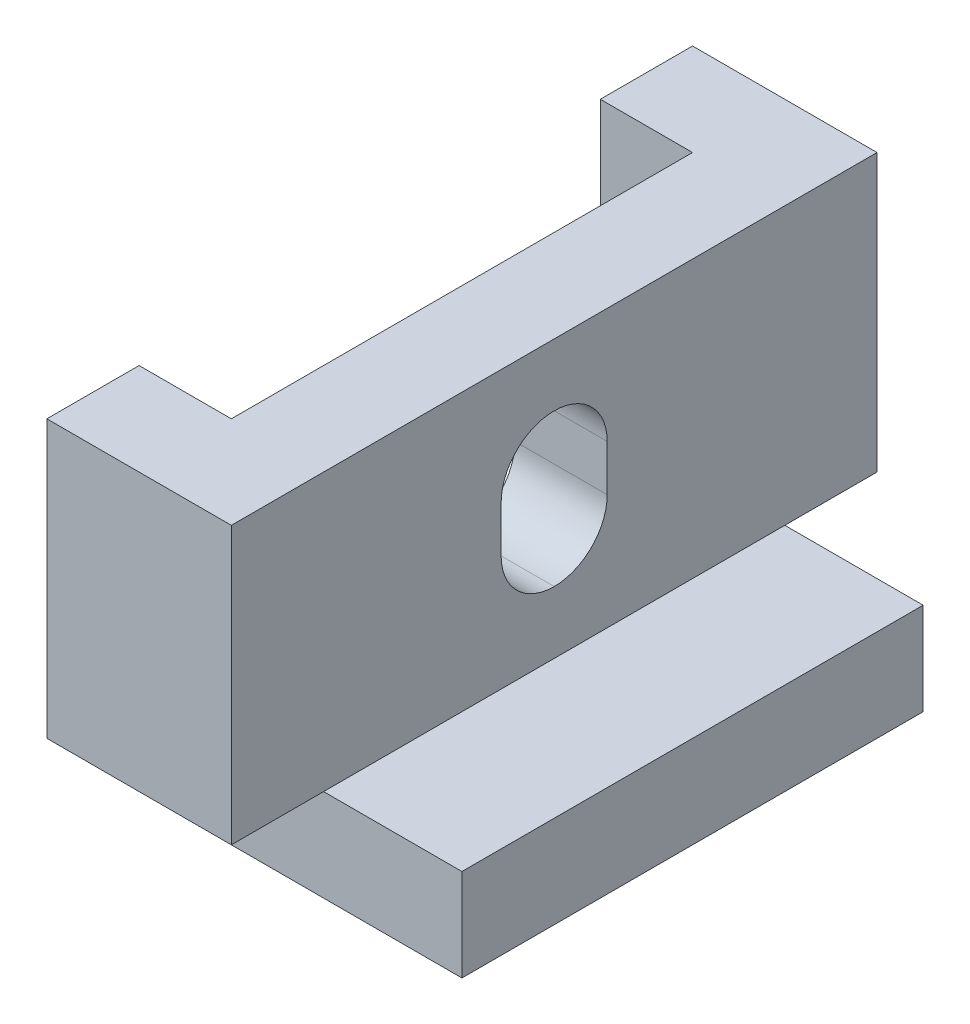
ISO-10303-21;
HEADER;
FILE_DESCRIPTION(('STEP AP214'),'2;1');
FILE_NAME('part.step','',(''),(''),'','','');
FILE_SCHEMA(('AUTOMOTIVE_DESIGN { 1 0 10303 214 1 1 1 1 }'));
ENDSEC;
DATA;
#1=APPLICATION_CONTEXT('core data for automotive mechanical design processes');
#2=APPLICATION_PROTOCOL_DEFINITION('international standard','automotive_design',2000,#1);
#3=PRODUCT_CONTEXT('',#1,'mechanical');
#4=PRODUCT('Part','Part','',(#3));
#5=PRODUCT_RELATED_PRODUCT_CATEGORY('part','',(#4));
#6=PRODUCT_DEFINITION_FORMATION('','',#4);
#7=PRODUCT_DEFINITION_CONTEXT('part definition',#1,'design');
#8=PRODUCT_DEFINITION('design','',#6,#7);
#9=PRODUCT_DEFINITION_SHAPE('','',#8);
#10=(LENGTH_UNIT() NAMED_UNIT(*) SI_UNIT(.MILLI.,.METRE.));
#11=(NAMED_UNIT(*) PLANE_ANGLE_UNIT() SI_UNIT($,.RADIAN.));
#12=(NAMED_UNIT(*) SI_UNIT($,.STERADIAN.) SOLID_ANGLE_UNIT());
#13=UNCERTAINTY_MEASURE_WITH_UNIT(LENGTH_MEASURE(1.E-05),#10,'distance_accuracy_value','');
#14=(GEOMETRIC_REPRESENTATION_CONTEXT(3) GLOBAL_UNCERTAINTY_ASSIGNED_CONTEXT((#13)) GLOBAL_UNIT_ASSIGNED_CONTEXT((#10,
#11,#12)) REPRESENTATION_CONTEXT('',''));
#15=CARTESIAN_POINT('',(0.,0.,0.));
#16=DIRECTION('',(0.,0.,1.));
#17=DIRECTION('',(1.,0.,0.));
#18=AXIS2_PLACEMENT_3D('',#15,#16,#17);
#19=CARTESIAN_POINT('',(0.,0.,14.));
#20=DIRECTION('',(1.,0.,0.));
#21=DIRECTION('',(0.,0.,-1.));
#22=AXIS2_PLACEMENT_3D('',#19,#20,#21);
#23=PLANE('',#22);
#24=DIRECTION('',(0.,-1.,0.));
#25=VECTOR('',#24,1.);
#26=CARTESIAN_POINT('',(0.,0.,0.));
#27=LINE('',#26,#25);
#28=CARTESIAN_POINT('',(0.,8.,0.));
#29=VERTEX_POINT('',#28);
#30=CARTESIAN_POINT('',(0.,2.,0.));
#31=VERTEX_POINT('',#30);
#32=EDGE_CURVE('E179',#29,#31,#27,.T.);
#33=ORIENTED_EDGE('',*,*,#32,.T.);
#34=DIRECTION('',(0.,0.,1.));
#35=VECTOR('',#34,1.);
#36=CARTESIAN_POINT('',(0.,2.,0.));
#37=LINE('',#36,#35);
#38=CARTESIAN_POINT('',(0.,2.,2.));
#39=VERTEX_POINT('',#38);
#40=EDGE_CURVE('E161',#31,#39,#37,.T.);
#41=ORIENTED_EDGE('',*,*,#40,.T.);
#42=DIRECTION('',(0.,1.,0.));
#43=VECTOR('',#42,1.);
#44=CARTESIAN_POINT('',(0.,0.,2.));
#45=LINE('',#44,#43);
#46=CARTESIAN_POINT('',(0.,8.,2.));
#47=VERTEX_POINT('',#46);
#48=EDGE_CURVE('E187',#39,#47,#45,.T.);
#49=ORIENTED_EDGE('',*,*,#48,.T.);
#50=DIRECTION('',(0.,0.,-1.));
#51=VECTOR('',#50,1.);
#52=CARTESIAN_POINT('',(0.,8.,14.));
#53=LINE('',#52,#51);
#54=EDGE_CURVE('E185',#47,#29,#53,.T.);
#55=ORIENTED_EDGE('',*,*,#54,.T.);
#56=EDGE_LOOP('',(#33,#41,#49,#55));
#57=FACE_BOUND('',#56,.T.);
#58=ADVANCED_FACE('F36',(#57),#23,.F.);
#59=DIRECTION('',(0.,1.,0.));
#60=VECTOR('',#59,1.);
#61=CARTESIAN_POINT('',(0.,0.,12.));
#62=LINE('',#61,#60);
#63=CARTESIAN_POINT('',(0.,2.,12.));
#64=VERTEX_POINT('',#63);
#65=CARTESIAN_POINT('',(0.,8.,12.));
#66=VERTEX_POINT('',#65);
#67=EDGE_CURVE('E292',#64,#66,#62,.T.);
#68=ORIENTED_EDGE('',*,*,#67,.F.);
#69=DIRECTION('',(0.,0.,1.));
#70=VECTOR('',#69,1.);
#71=CARTESIAN_POINT('',(0.,2.,14.));
#72=LINE('',#71,#70);
#73=CARTESIAN_POINT('',(0.,2.,14.));
#74=VERTEX_POINT('',#73);
#75=EDGE_CURVE('E261',#64,#74,#72,.T.);
#76=ORIENTED_EDGE('',*,*,#75,.T.);
#77=DIRECTION('',(0.,-1.,0.));
#78=VECTOR('',#77,1.);
#79=CARTESIAN_POINT('',(0.,0.,14.));
#80=LINE('',#79,#78);
#81=CARTESIAN_POINT('',(0.,8.,14.));
#82=VERTEX_POINT('',#81);
#83=EDGE_CURVE('E189',#82,#74,#80,.T.);
#84=ORIENTED_EDGE('',*,*,#83,.F.);
#85=EDGE_CURVE('E197',#82,#66,#53,.T.);
#86=ORIENTED_EDGE('',*,*,#85,.T.);
#87=EDGE_LOOP('',(#68,#76,#84,#86));
#88=FACE_BOUND('',#87,.T.);
#89=ADVANCED_FACE('F321',(#88),#23,.F.);
#90=CARTESIAN_POINT('',(0.,0.,14.));
#91=DIRECTION('',(0.,1.,0.));
#92=DIRECTION('',(0.,0.,1.));
#93=AXIS2_PLACEMENT_3D('',#90,#91,#92);
#94=PLANE('',#93);
#95=DIRECTION('',(0.,0.,-1.));
#96=VECTOR('',#95,1.);
#97=CARTESIAN_POINT('',(2.,0.,2.));
#98=LINE('',#97,#96);
#99=CARTESIAN_POINT('',(2.,0.,12.));
#100=VERTEX_POINT('',#99);
#101=CARTESIAN_POINT('',(2.,0.,2.));
#102=VERTEX_POINT('',#101);
#103=EDGE_CURVE('E289',#100,#102,#98,.T.);
#104=ORIENTED_EDGE('',*,*,#103,.T.);
#105=DIRECTION('',(1.,0.,0.));
#106=VECTOR('',#105,1.);
#107=CARTESIAN_POINT('',(0.,0.,2.));
#108=LINE('',#107,#106);
#109=CARTESIAN_POINT('',(7.,0.,2.));
#110=VERTEX_POINT('',#109);
#111=EDGE_CURVE('E255',#102,#110,#108,.T.);
#112=ORIENTED_EDGE('',*,*,#111,.T.);
#113=DIRECTION('',(0.,0.,-1.));
#114=VECTOR('',#113,1.);
#115=CARTESIAN_POINT('',(7.,0.,14.));
#116=LINE('',#115,#114);
#117=CARTESIAN_POINT('',(7.,0.,12.));
#118=VERTEX_POINT('',#117);
#119=EDGE_CURVE('E200',#118,#110,#116,.T.);
#120=ORIENTED_EDGE('',*,*,#119,.F.);
#121=DIRECTION('',(1.,0.,0.));
#122=VECTOR('',#121,1.);
#123=CARTESIAN_POINT('',(0.,0.,12.));
#124=LINE('',#123,#122);
#125=EDGE_CURVE('E264',#100,#118,#124,.T.);
#126=ORIENTED_EDGE('',*,*,#125,.F.);
#127=EDGE_LOOP('',(#104,#112,#120,#126));
#128=FACE_BOUND('',#127,.T.);
#129=ADVANCED_FACE('F338',(#128),#94,.F.);
#130=CARTESIAN_POINT('',(7.,0.,14.));
#131=DIRECTION('',(-1.,0.,0.));
#132=DIRECTION('',(0.,-1.,0.));
#133=AXIS2_PLACEMENT_3D('',#130,#131,#132);
#134=PLANE('',#133);
#135=ORIENTED_EDGE('',*,*,#119,.T.);
#136=DIRECTION('',(0.,-1.,0.));
#137=VECTOR('',#136,1.);
#138=CARTESIAN_POINT('',(7.,2.,2.));
#139=LINE('',#138,#137);
#140=CARTESIAN_POINT('',(7.,2.,2.));
#141=VERTEX_POINT('',#140);
#142=EDGE_CURVE('E172',#141,#110,#139,.T.);
#143=ORIENTED_EDGE('',*,*,#142,.F.);
#144=DIRECTION('',(0.,0.,1.));
#145=VECTOR('',#144,1.);
#146=CARTESIAN_POINT('',(7.,2.,0.));
#147=LINE('',#146,#145);
#148=CARTESIAN_POINT('',(7.,2.,12.));
#149=VERTEX_POINT('',#148);
#150=EDGE_CURVE('E281',#141,#149,#147,.T.);
#151=ORIENTED_EDGE('',*,*,#150,.T.);
#152=DIRECTION('',(0.,1.,0.));
#153=VECTOR('',#152,1.);
#154=CARTESIAN_POINT('',(7.,2.,12.));
#155=LINE('',#154,#153);
#156=EDGE_CURVE('E258',#118,#149,#155,.T.);
#157=ORIENTED_EDGE('',*,*,#156,.F.);
#158=EDGE_LOOP('',(#135,#143,#151,#157));
#159=FACE_BOUND('',#158,.T.);
#160=ADVANCED_FACE('F341',(#159),#134,.F.);
#161=CARTESIAN_POINT('',(0.,8.,14.));
#162=DIRECTION('',(0.,-1.,0.));
#163=DIRECTION('',(0.,0.,-1.));
#164=AXIS2_PLACEMENT_3D('',#161,#162,#163);
#165=PLANE('',#164);
#166=DIRECTION('',(-1.,0.,0.));
#167=VECTOR('',#166,1.);
#168=CARTESIAN_POINT('',(0.,8.,14.));
#169=LINE('',#168,#167);
#170=CARTESIAN_POINT('',(4.,8.,14.));
#171=VERTEX_POINT('',#170);
#172=EDGE_CURVE('E194',#171,#82,#169,.T.);
#173=ORIENTED_EDGE('',*,*,#172,.F.);
#174=DIRECTION('',(0.,0.,1.));
#175=VECTOR('',#174,1.);
#176=CARTESIAN_POINT('',(4.,8.,0.));
#177=LINE('',#176,#175);
#178=CARTESIAN_POINT('',(4.,8.,0.));
#179=VERTEX_POINT('',#178);
#180=EDGE_CURVE('E278',#179,#171,#177,.T.);
#181=ORIENTED_EDGE('',*,*,#180,.F.);
#182=DIRECTION('',(-1.,0.,0.));
#183=VECTOR('',#182,1.);
#184=CARTESIAN_POINT('',(0.,8.,0.));
#185=LINE('',#184,#183);
#186=EDGE_CURVE('E186',#179,#29,#185,.T.);
#187=ORIENTED_EDGE('',*,*,#186,.T.);
#188=ORIENTED_EDGE('',*,*,#54,.F.);
#189=DIRECTION('',(-1.,0.,0.));
#190=VECTOR('',#189,1.);
#191=CARTESIAN_POINT('',(0.,8.,2.));
#192=LINE('',#191,#190);
#193=CARTESIAN_POINT('',(2.,8.,2.));
#194=VERTEX_POINT('',#193);
#195=EDGE_CURVE('E293',#194,#47,#192,.T.);
#196=ORIENTED_EDGE('',*,*,#195,.F.);
#197=DIRECTION('',(0.,0.,-1.));
#198=VECTOR('',#197,1.);
#199=CARTESIAN_POINT('',(2.,8.,2.));
#200=LINE('',#199,#198);
#201=CARTESIAN_POINT('',(2.,8.,12.));
#202=VERTEX_POINT('',#201);
#203=EDGE_CURVE('E296',#202,#194,#200,.T.);
#204=ORIENTED_EDGE('',*,*,#203,.F.);
#205=DIRECTION('',(1.,0.,0.));
#206=VECTOR('',#205,1.);
#207=CARTESIAN_POINT('',(0.,8.,12.));
#208=LINE('',#207,#206);
#209=EDGE_CURVE('E283',#66,#202,#208,.T.);
#210=ORIENTED_EDGE('',*,*,#209,.F.);
#211=ORIENTED_EDGE('',*,*,#85,.F.);
#212=EDGE_LOOP('',(#173,#181,#187,#188,#196,#204,#210,#211));
#213=FACE_BOUND('',#212,.T.);
#214=ADVANCED_FACE('F317',(#213),#165,.F.);
#215=CARTESIAN_POINT('',(0.,8.,14.));
#216=DIRECTION('',(0.,0.,-1.));
#217=DIRECTION('',(-1.,0.,0.));
#218=AXIS2_PLACEMENT_3D('',#215,#216,#217);
#219=PLANE('',#218);
#220=ORIENTED_EDGE('',*,*,#83,.T.);
#221=DIRECTION('',(1.,0.,0.));
#222=VECTOR('',#221,1.);
#223=CARTESIAN_POINT('',(0.,2.,14.));
#224=LINE('',#223,#222);
#225=CARTESIAN_POINT('',(4.,2.,14.));
#226=VERTEX_POINT('',#225);
#227=EDGE_CURVE('E267',#74,#226,#224,.T.);
#228=ORIENTED_EDGE('',*,*,#227,.T.);
#229=DIRECTION('',(0.,-1.,0.));
#230=VECTOR('',#229,1.);
#231=CARTESIAN_POINT('',(4.,8.,14.));
#232=LINE('',#231,#230);
#233=EDGE_CURVE('E270',#171,#226,#232,.T.);
#234=ORIENTED_EDGE('',*,*,#233,.F.);
#235=ORIENTED_EDGE('',*,*,#172,.T.);
#236=EDGE_LOOP('',(#220,#228,#234,#235));
#237=FACE_BOUND('',#236,.T.);
#238=ADVANCED_FACE('F313',(#237),#219,.F.);
#239=CARTESIAN_POINT('',(0.,8.,0.));
#240=DIRECTION('',(0.,0.,-1.));
#241=DIRECTION('',(-1.,0.,0.));
#242=AXIS2_PLACEMENT_3D('',#239,#240,#241);
#243=PLANE('',#242);
#244=DIRECTION('',(1.,0.,0.));
#245=VECTOR('',#244,1.);
#246=CARTESIAN_POINT('',(0.,2.,0.));
#247=LINE('',#246,#245);
#248=CARTESIAN_POINT('',(4.,2.,0.));
#249=VERTEX_POINT('',#248);
#250=EDGE_CURVE('E165',#31,#249,#247,.T.);
#251=ORIENTED_EDGE('',*,*,#250,.F.);
#252=ORIENTED_EDGE('',*,*,#32,.F.);
#253=ORIENTED_EDGE('',*,*,#186,.F.);
#254=DIRECTION('',(0.,-1.,0.));
#255=VECTOR('',#254,1.);
#256=CARTESIAN_POINT('',(4.,8.,0.));
#257=LINE('',#256,#255);
#258=EDGE_CURVE('E180',#179,#249,#257,.T.);
#259=ORIENTED_EDGE('',*,*,#258,.T.);
#260=EDGE_LOOP('',(#251,#252,#253,#259));
#261=FACE_BOUND('',#260,.T.);
#262=ADVANCED_FACE('F177',(#261),#243,.T.);
#263=CARTESIAN_POINT('',(0.,0.,2.));
#264=DIRECTION('',(0.,0.,-1.));
#265=DIRECTION('',(-1.,0.,0.));
#266=AXIS2_PLACEMENT_3D('',#263,#264,#265);
#267=PLANE('',#266);
#268=ORIENTED_EDGE('',*,*,#48,.F.);
#269=DIRECTION('',(1.,0.,0.));
#270=VECTOR('',#269,1.);
#271=CARTESIAN_POINT('',(0.,2.,2.));
#272=LINE('',#271,#270);
#273=CARTESIAN_POINT('',(2.,2.,2.));
#274=VERTEX_POINT('',#273);
#275=EDGE_CURVE('E168',#39,#274,#272,.T.);
#276=ORIENTED_EDGE('',*,*,#275,.T.);
#277=DIRECTION('',(0.,1.,0.));
#278=VECTOR('',#277,1.);
#279=CARTESIAN_POINT('',(2.,0.,2.));
#280=LINE('',#279,#278);
#281=EDGE_CURVE('E302',#274,#194,#280,.T.);
#282=ORIENTED_EDGE('',*,*,#281,.T.);
#283=ORIENTED_EDGE('',*,*,#195,.T.);
#284=EDGE_LOOP('',(#268,#276,#282,#283));
#285=FACE_BOUND('',#284,.T.);
#286=ADVANCED_FACE('F353',(#285),#267,.F.);
#287=CARTESIAN_POINT('',(2.,0.,2.));
#288=DIRECTION('',(1.,0.,0.));
#289=DIRECTION('',(0.,0.,-1.));
#290=AXIS2_PLACEMENT_3D('',#287,#288,#289);
#291=PLANE('',#290);
#292=CARTESIAN_POINT('',(2.,4.5,7.));
#293=DIRECTION('',(1.,0.,0.));
#294=DIRECTION('',(0.,0.,-1.));
#295=AXIS2_PLACEMENT_3D('',#292,#293,#294);
#296=CIRCLE('',#295,1.15);
#297=CARTESIAN_POINT('',(2.,4.5,8.15));
#298=VERTEX_POINT('',#297);
#299=CARTESIAN_POINT('',(2.,3.35,7.));
#300=VERTEX_POINT('',#299);
#301=EDGE_CURVE('E52',#298,#300,#296,.T.);
#302=ORIENTED_EDGE('',*,*,#301,.T.);
#303=CARTESIAN_POINT('',(2.,4.5,7.));
#304=DIRECTION('',(1.,0.,0.));
#305=DIRECTION('',(0.,0.,-1.));
#306=AXIS2_PLACEMENT_3D('',#303,#304,#305);
#307=CIRCLE('',#306,1.15);
#308=CARTESIAN_POINT('',(2.,4.5,5.85));
#309=VERTEX_POINT('',#308);
#310=EDGE_CURVE('E11',#300,#309,#307,.T.);
#311=ORIENTED_EDGE('',*,*,#310,.T.);
#312=DIRECTION('',(0.,1.,0.));
#313=VECTOR('',#312,1.);
#314=CARTESIAN_POINT('',(2.,0.,5.85));
#315=LINE('',#314,#313);
#316=CARTESIAN_POINT('',(2.,5.5,5.85));
#317=VERTEX_POINT('',#316);
#318=EDGE_CURVE('E244',#309,#317,#315,.T.);
#319=ORIENTED_EDGE('',*,*,#318,.T.);
#320=CARTESIAN_POINT('',(2.,5.5,7.));
#321=DIRECTION('',(1.,0.,0.));
#322=DIRECTION('',(0.,0.,-1.));
#323=AXIS2_PLACEMENT_3D('',#320,#321,#322);
#324=CIRCLE('',#323,1.15);
#325=CARTESIAN_POINT('',(2.,6.65,7.));
#326=VERTEX_POINT('',#325);
#327=EDGE_CURVE('E215',#317,#326,#324,.T.);
#328=ORIENTED_EDGE('',*,*,#327,.T.);
#329=CARTESIAN_POINT('',(2.,5.5,7.));
#330=DIRECTION('',(1.,0.,0.));
#331=DIRECTION('',(0.,0.,-1.));
#332=AXIS2_PLACEMENT_3D('',#329,#330,#331);
#333=CIRCLE('',#332,1.15);
#334=CARTESIAN_POINT('',(2.,5.5,8.15));
#335=VERTEX_POINT('',#334);
#336=EDGE_CURVE('E219',#326,#335,#333,.T.);
#337=ORIENTED_EDGE('',*,*,#336,.T.);
#338=DIRECTION('',(0.,-1.,0.));
#339=VECTOR('',#338,1.);
#340=CARTESIAN_POINT('',(2.,0.,8.15));
#341=LINE('',#340,#339);
#342=EDGE_CURVE('E249',#335,#298,#341,.T.);
#343=ORIENTED_EDGE('',*,*,#342,.T.);
#344=EDGE_LOOP('',(#302,#311,#319,#328,#337,#343));
#345=FACE_BOUND('',#344,.T.);
#346=ORIENTED_EDGE('',*,*,#203,.T.);
#347=ORIENTED_EDGE('',*,*,#281,.F.);
#348=EDGE_CURVE('E191',#102,#274,#280,.T.);
#349=ORIENTED_EDGE('',*,*,#348,.F.);
#350=ORIENTED_EDGE('',*,*,#103,.F.);
#351=DIRECTION('',(0.,1.,0.));
#352=VECTOR('',#351,1.);
#353=CARTESIAN_POINT('',(2.,0.,12.));
#354=LINE('',#353,#352);
#355=CARTESIAN_POINT('',(2.,2.,12.));
#356=VERTEX_POINT('',#355);
#357=EDGE_CURVE('E303',#100,#356,#354,.T.);
#358=ORIENTED_EDGE('',*,*,#357,.T.);
#359=EDGE_CURVE('E306',#356,#202,#354,.T.);
#360=ORIENTED_EDGE('',*,*,#359,.T.);
#361=EDGE_LOOP('',(#346,#347,#349,#350,#358,#360));
#362=FACE_BOUND('',#361,.T.);
#363=ADVANCED_FACE('F242',(#345,#362),#291,.F.);
#364=CARTESIAN_POINT('',(0.,0.,12.));
#365=DIRECTION('',(0.,0.,1.));
#366=DIRECTION('',(1.,0.,0.));
#367=AXIS2_PLACEMENT_3D('',#364,#365,#366);
#368=PLANE('',#367);
#369=ORIENTED_EDGE('',*,*,#359,.F.);
#370=DIRECTION('',(1.,0.,0.));
#371=VECTOR('',#370,1.);
#372=CARTESIAN_POINT('',(0.,2.,12.));
#373=LINE('',#372,#371);
#374=EDGE_CURVE('E271',#64,#356,#373,.T.);
#375=ORIENTED_EDGE('',*,*,#374,.F.);
#376=ORIENTED_EDGE('',*,*,#67,.T.);
#377=ORIENTED_EDGE('',*,*,#209,.T.);
#378=EDGE_LOOP('',(#369,#375,#376,#377));
#379=FACE_BOUND('',#378,.T.);
#380=ADVANCED_FACE('F328',(#379),#368,.F.);
#381=CARTESIAN_POINT('',(7.,2.,0.));
#382=DIRECTION('',(0.,-1.,0.));
#383=DIRECTION('',(0.,0.,-1.));
#384=AXIS2_PLACEMENT_3D('',#381,#382,#383);
#385=PLANE('',#384);
#386=ORIENTED_EDGE('',*,*,#150,.F.);
#387=CARTESIAN_POINT('',(4.,2.,2.));
#388=VERTEX_POINT('',#387);
#389=EDGE_CURVE('E181',#388,#141,#272,.T.);
#390=ORIENTED_EDGE('',*,*,#389,.F.);
#391=DIRECTION('',(0.,0.,1.));
#392=VECTOR('',#391,1.);
#393=CARTESIAN_POINT('',(4.,2.,0.));
#394=LINE('',#393,#392);
#395=CARTESIAN_POINT('',(4.,2.,12.));
#396=VERTEX_POINT('',#395);
#397=EDGE_CURVE('E286',#388,#396,#394,.T.);
#398=ORIENTED_EDGE('',*,*,#397,.T.);
#399=EDGE_CURVE('E275',#396,#149,#373,.T.);
#400=ORIENTED_EDGE('',*,*,#399,.T.);
#401=EDGE_LOOP('',(#386,#390,#398,#400));
#402=FACE_BOUND('',#401,.T.);
#403=ADVANCED_FACE('F346',(#402),#385,.F.);
#404=CARTESIAN_POINT('',(4.,8.,0.));
#405=DIRECTION('',(-1.,0.,0.));
#406=DIRECTION('',(0.,-1.,0.));
#407=AXIS2_PLACEMENT_3D('',#404,#405,#406);
#408=PLANE('',#407);
#409=DIRECTION('',(0.,-1.,0.));
#410=VECTOR('',#409,1.);
#411=CARTESIAN_POINT('',(4.,6.65,8.15));
#412=LINE('',#411,#410);
#413=CARTESIAN_POINT('',(4.,5.5,8.15));
#414=VERTEX_POINT('',#413);
#415=CARTESIAN_POINT('',(4.,4.5,8.15));
#416=VERTEX_POINT('',#415);
#417=EDGE_CURVE('E226',#414,#416,#412,.T.);
#418=ORIENTED_EDGE('',*,*,#417,.F.);
#419=CARTESIAN_POINT('',(4.,5.5,7.));
#420=DIRECTION('',(-1.,0.,0.));
#421=DIRECTION('',(0.,-1.,0.));
#422=AXIS2_PLACEMENT_3D('',#419,#420,#421);
#423=CIRCLE('',#422,1.15);
#424=CARTESIAN_POINT('',(4.,6.65,7.));
#425=VERTEX_POINT('',#424);
#426=EDGE_CURVE('E217',#414,#425,#423,.T.);
#427=ORIENTED_EDGE('',*,*,#426,.T.);
#428=CARTESIAN_POINT('',(4.,5.5,7.));
#429=DIRECTION('',(-1.,0.,0.));
#430=DIRECTION('',(0.,-1.,0.));
#431=AXIS2_PLACEMENT_3D('',#428,#429,#430);
#432=CIRCLE('',#431,1.15);
#433=CARTESIAN_POINT('',(4.,5.5,5.85));
#434=VERTEX_POINT('',#433);
#435=EDGE_CURVE('E213',#425,#434,#432,.T.);
#436=ORIENTED_EDGE('',*,*,#435,.T.);
#437=DIRECTION('',(0.,1.,0.));
#438=VECTOR('',#437,1.);
#439=CARTESIAN_POINT('',(4.,6.65,5.85));
#440=LINE('',#439,#438);
#441=CARTESIAN_POINT('',(4.,4.5,5.85));
#442=VERTEX_POINT('',#441);
#443=EDGE_CURVE('E231',#442,#434,#440,.T.);
#444=ORIENTED_EDGE('',*,*,#443,.F.);
#445=CARTESIAN_POINT('',(4.,4.5,7.));
#446=DIRECTION('',(-1.,0.,0.));
#447=DIRECTION('',(0.,-1.,0.));
#448=AXIS2_PLACEMENT_3D('',#445,#446,#447);
#449=CIRCLE('',#448,1.15);
#450=CARTESIAN_POINT('',(4.,3.35,7.));
#451=VERTEX_POINT('',#450);
#452=EDGE_CURVE('E45',#442,#451,#449,.T.);
#453=ORIENTED_EDGE('',*,*,#452,.T.);
#454=CARTESIAN_POINT('',(4.,4.5,7.));
#455=DIRECTION('',(-1.,0.,0.));
#456=DIRECTION('',(0.,-1.,0.));
#457=AXIS2_PLACEMENT_3D('',#454,#455,#456);
#458=CIRCLE('',#457,1.15);
#459=EDGE_CURVE('E221',#451,#416,#458,.T.);
#460=ORIENTED_EDGE('',*,*,#459,.T.);
#461=EDGE_LOOP('',(#418,#427,#436,#444,#453,#460));
#462=FACE_BOUND('',#461,.T.);
#463=ORIENTED_EDGE('',*,*,#233,.T.);
#464=EDGE_CURVE('E287',#396,#226,#394,.T.);
#465=ORIENTED_EDGE('',*,*,#464,.F.);
#466=ORIENTED_EDGE('',*,*,#397,.F.);
#467=EDGE_CURVE('E284',#249,#388,#394,.T.);
#468=ORIENTED_EDGE('',*,*,#467,.F.);
#469=ORIENTED_EDGE('',*,*,#258,.F.);
#470=ORIENTED_EDGE('',*,*,#180,.T.);
#471=EDGE_LOOP('',(#463,#465,#466,#468,#469,#470));
#472=FACE_BOUND('',#471,.T.);
#473=ADVANCED_FACE('F350',(#462,#472),#408,.F.);
#474=CARTESIAN_POINT('',(0.,2.,12.));
#475=DIRECTION('',(0.,0.,-1.));
#476=DIRECTION('',(-1.,0.,0.));
#477=AXIS2_PLACEMENT_3D('',#474,#475,#476);
#478=PLANE('',#477);
#479=ORIENTED_EDGE('',*,*,#125,.T.);
#480=ORIENTED_EDGE('',*,*,#156,.T.);
#481=ORIENTED_EDGE('',*,*,#399,.F.);
#482=EDGE_CURVE('E274',#356,#396,#373,.T.);
#483=ORIENTED_EDGE('',*,*,#482,.F.);
#484=ORIENTED_EDGE('',*,*,#357,.F.);
#485=EDGE_LOOP('',(#479,#480,#481,#483,#484));
#486=FACE_BOUND('',#485,.T.);
#487=ADVANCED_FACE('F333',(#486),#478,.F.);
#488=CARTESIAN_POINT('',(0.,2.,14.));
#489=DIRECTION('',(0.,1.,0.));
#490=DIRECTION('',(-1.,0.,0.));
#491=AXIS2_PLACEMENT_3D('',#488,#489,#490);
#492=PLANE('',#491);
#493=ORIENTED_EDGE('',*,*,#227,.F.);
#494=ORIENTED_EDGE('',*,*,#75,.F.);
#495=ORIENTED_EDGE('',*,*,#374,.T.);
#496=ORIENTED_EDGE('',*,*,#482,.T.);
#497=ORIENTED_EDGE('',*,*,#464,.T.);
#498=EDGE_LOOP('',(#493,#494,#495,#496,#497));
#499=FACE_BOUND('',#498,.T.);
#500=ADVANCED_FACE('F324',(#499),#492,.F.);
#501=CARTESIAN_POINT('',(0.,2.,2.));
#502=DIRECTION('',(0.,0.,1.));
#503=DIRECTION('',(0.,-1.,0.));
#504=AXIS2_PLACEMENT_3D('',#501,#502,#503);
#505=PLANE('',#504);
#506=EDGE_CURVE('E259',#274,#388,#272,.T.);
#507=ORIENTED_EDGE('',*,*,#506,.T.);
#508=ORIENTED_EDGE('',*,*,#389,.T.);
#509=ORIENTED_EDGE('',*,*,#142,.T.);
#510=ORIENTED_EDGE('',*,*,#111,.F.);
#511=ORIENTED_EDGE('',*,*,#348,.T.);
#512=EDGE_LOOP('',(#507,#508,#509,#510,#511));
#513=FACE_BOUND('',#512,.T.);
#514=ADVANCED_FACE('F357',(#513),#505,.F.);
#515=CARTESIAN_POINT('',(0.,2.,0.));
#516=DIRECTION('',(0.,1.,0.));
#517=DIRECTION('',(0.,0.,1.));
#518=AXIS2_PLACEMENT_3D('',#515,#516,#517);
#519=PLANE('',#518);
#520=ORIENTED_EDGE('',*,*,#506,.F.);
#521=ORIENTED_EDGE('',*,*,#275,.F.);
#522=ORIENTED_EDGE('',*,*,#40,.F.);
#523=ORIENTED_EDGE('',*,*,#250,.T.);
#524=ORIENTED_EDGE('',*,*,#467,.T.);
#525=EDGE_LOOP('',(#520,#521,#522,#523,#524));
#526=FACE_BOUND('',#525,.T.);
#527=ADVANCED_FACE('F164',(#526),#519,.F.);
#528=CARTESIAN_POINT('',(0.,6.65,5.85));
#529=DIRECTION('',(0.,0.,-1.));
#530=DIRECTION('',(-1.,0.,0.));
#531=AXIS2_PLACEMENT_3D('',#528,#529,#530);
#532=PLANE('',#531);
#533=ORIENTED_EDGE('',*,*,#443,.T.);
#534=DIRECTION('',(1.,0.,0.));
#535=VECTOR('',#534,1.);
#536=CARTESIAN_POINT('',(2.,5.5,5.85));
#537=LINE('',#536,#535);
#538=EDGE_CURVE('E205',#434,#317,#537,.F.);
#539=ORIENTED_EDGE('',*,*,#538,.T.);
#540=ORIENTED_EDGE('',*,*,#318,.F.);
#541=DIRECTION('',(1.,0.,0.));
#542=VECTOR('',#541,1.);
#543=CARTESIAN_POINT('',(4.,4.5,5.85));
#544=LINE('',#543,#542);
#545=EDGE_CURVE('E203',#309,#442,#544,.T.);
#546=ORIENTED_EDGE('',*,*,#545,.T.);
#547=EDGE_LOOP('',(#533,#539,#540,#546));
#548=FACE_BOUND('',#547,.T.);
#549=ADVANCED_FACE('F247',(#548),#532,.F.);
#550=CARTESIAN_POINT('',(0.,6.65,8.15));
#551=DIRECTION('',(0.,0.,1.));
#552=DIRECTION('',(1.,0.,0.));
#553=AXIS2_PLACEMENT_3D('',#550,#551,#552);
#554=PLANE('',#553);
#555=ORIENTED_EDGE('',*,*,#342,.F.);
#556=DIRECTION('',(1.,0.,0.));
#557=VECTOR('',#556,1.);
#558=CARTESIAN_POINT('',(4.,5.5,8.15));
#559=LINE('',#558,#557);
#560=EDGE_CURVE('E211',#335,#414,#559,.T.);
#561=ORIENTED_EDGE('',*,*,#560,.T.);
#562=ORIENTED_EDGE('',*,*,#417,.T.);
#563=DIRECTION('',(1.,0.,0.));
#564=VECTOR('',#563,1.);
#565=CARTESIAN_POINT('',(2.,4.5,8.15));
#566=LINE('',#565,#564);
#567=EDGE_CURVE('E208',#416,#298,#566,.F.);
#568=ORIENTED_EDGE('',*,*,#567,.T.);
#569=EDGE_LOOP('',(#555,#561,#562,#568));
#570=FACE_BOUND('',#569,.T.);
#571=ADVANCED_FACE('F380',(#570),#554,.F.);
#572=CARTESIAN_POINT('',(0.,5.5,7.));
#573=DIRECTION('',(-1.,0.,0.));
#574=DIRECTION('',(0.,-1.,0.));
#575=AXIS2_PLACEMENT_3D('',#572,#573,#574);
#576=CYLINDRICAL_SURFACE('',#575,1.15);
#577=ORIENTED_EDGE('',*,*,#560,.F.);
#578=ORIENTED_EDGE('',*,*,#336,.F.);
#579=DIRECTION('',(1.,0.,0.));
#580=VECTOR('',#579,1.);
#581=CARTESIAN_POINT('',(2.,6.65,7.));
#582=LINE('',#581,#580);
#583=EDGE_CURVE('E224',#425,#326,#582,.F.);
#584=ORIENTED_EDGE('',*,*,#583,.F.);
#585=ORIENTED_EDGE('',*,*,#426,.F.);
#586=EDGE_LOOP('',(#577,#578,#584,#585));
#587=FACE_BOUND('',#586,.T.);
#588=ADVANCED_FACE('F378',(#587),#576,.F.);
#589=CARTESIAN_POINT('',(0.,5.5,7.));
#590=DIRECTION('',(-1.,0.,0.));
#591=DIRECTION('',(0.,-1.,0.));
#592=AXIS2_PLACEMENT_3D('',#589,#590,#591);
#593=CYLINDRICAL_SURFACE('',#592,1.15);
#594=ORIENTED_EDGE('',*,*,#327,.F.);
#595=ORIENTED_EDGE('',*,*,#538,.F.);
#596=ORIENTED_EDGE('',*,*,#435,.F.);
#597=ORIENTED_EDGE('',*,*,#583,.T.);
#598=EDGE_LOOP('',(#594,#595,#596,#597));
#599=FACE_BOUND('',#598,.T.);
#600=ADVANCED_FACE('F375',(#599),#593,.F.);
#601=CARTESIAN_POINT('',(0.,4.5,7.));
#602=DIRECTION('',(-1.,0.,0.));
#603=DIRECTION('',(0.,-1.,0.));
#604=AXIS2_PLACEMENT_3D('',#601,#602,#603);
#605=CYLINDRICAL_SURFACE('',#604,1.15);
#606=ORIENTED_EDGE('',*,*,#545,.F.);
#607=ORIENTED_EDGE('',*,*,#310,.F.);
#608=DIRECTION('',(1.,0.,0.));
#609=VECTOR('',#608,1.);
#610=CARTESIAN_POINT('',(2.,3.35,7.));
#611=LINE('',#610,#609);
#612=EDGE_CURVE('E40',#451,#300,#611,.F.);
#613=ORIENTED_EDGE('',*,*,#612,.F.);
#614=ORIENTED_EDGE('',*,*,#452,.F.);
#615=EDGE_LOOP('',(#606,#607,#613,#614));
#616=FACE_BOUND('',#615,.T.);
#617=ADVANCED_FACE('F38',(#616),#605,.F.);
#618=CARTESIAN_POINT('',(0.,4.5,7.));
#619=DIRECTION('',(-1.,0.,0.));
#620=DIRECTION('',(0.,-1.,0.));
#621=AXIS2_PLACEMENT_3D('',#618,#619,#620);
#622=CYLINDRICAL_SURFACE('',#621,1.15);
#623=ORIENTED_EDGE('',*,*,#301,.F.);
#624=ORIENTED_EDGE('',*,*,#567,.F.);
#625=ORIENTED_EDGE('',*,*,#459,.F.);
#626=ORIENTED_EDGE('',*,*,#612,.T.);
#627=EDGE_LOOP('',(#623,#624,#625,#626));
#628=FACE_BOUND('',#627,.T.);
#629=ADVANCED_FACE('F236',(#628),#622,.F.);
#630=CLOSED_SHELL('',(#58,#89,#129,#160,#214,#238,#262,#286,#363,#380,#403,#473,#487,#500,#514,
#527,#549,#571,#588,#600,#617,#629));
#631=MANIFOLD_SOLID_BREP('B2',#630);
#632=ADVANCED_BREP_SHAPE_REPRESENTATION('',(#18,#631),#14);
#633=SHAPE_DEFINITION_REPRESENTATION(#9,#632);
ENDSEC;
END-ISO-10303-21;
